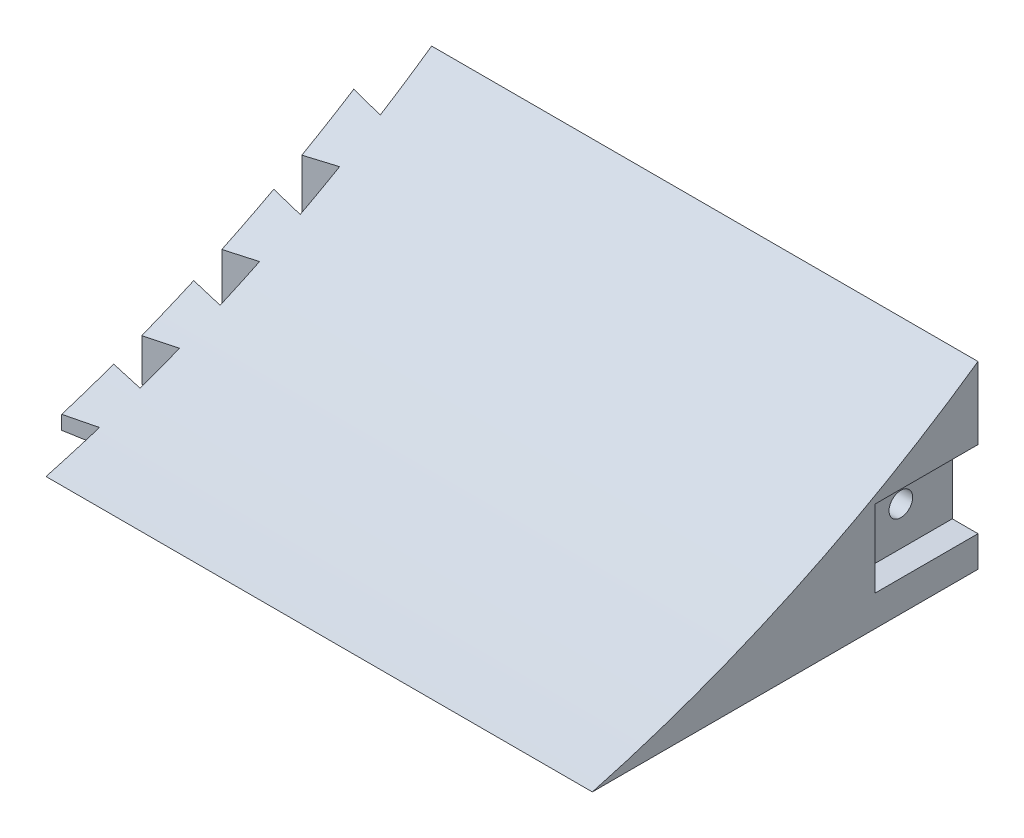
ISO-10303-21;
HEADER;
FILE_DESCRIPTION(('STEP AP214'),'2;1');
FILE_NAME('part.step','',(''),(''),'','','');
FILE_SCHEMA(('AUTOMOTIVE_DESIGN { 1 0 10303 214 1 1 1 1 }'));
ENDSEC;
DATA;
#1=APPLICATION_CONTEXT('core data for automotive mechanical design processes');
#2=APPLICATION_PROTOCOL_DEFINITION('international standard','automotive_design',2000,#1);
#3=PRODUCT_CONTEXT('',#1,'mechanical');
#4=PRODUCT('Part','Part','',(#3));
#5=PRODUCT_RELATED_PRODUCT_CATEGORY('part','',(#4));
#6=PRODUCT_DEFINITION_FORMATION('','',#4);
#7=PRODUCT_DEFINITION_CONTEXT('part definition',#1,'design');
#8=PRODUCT_DEFINITION('design','',#6,#7);
#9=PRODUCT_DEFINITION_SHAPE('','',#8);
#10=(LENGTH_UNIT() NAMED_UNIT(*) SI_UNIT(.MILLI.,.METRE.));
#11=(NAMED_UNIT(*) PLANE_ANGLE_UNIT() SI_UNIT($,.RADIAN.));
#12=(NAMED_UNIT(*) SI_UNIT($,.STERADIAN.) SOLID_ANGLE_UNIT());
#13=UNCERTAINTY_MEASURE_WITH_UNIT(LENGTH_MEASURE(1.E-05),#10,'distance_accuracy_value','');
#14=(GEOMETRIC_REPRESENTATION_CONTEXT(3) GLOBAL_UNCERTAINTY_ASSIGNED_CONTEXT((#13)) GLOBAL_UNIT_ASSIGNED_CONTEXT((#10,
#11,#12)) REPRESENTATION_CONTEXT('',''));
#15=CARTESIAN_POINT('',(0.,0.,0.));
#16=DIRECTION('',(0.,0.,1.));
#17=DIRECTION('',(1.,0.,0.));
#18=AXIS2_PLACEMENT_3D('',#15,#16,#17);
#19=CARTESIAN_POINT('',(0.,294.29273435255,79.3399426978569));
#20=DIRECTION('',(1.,0.,0.));
#21=DIRECTION('',(0.,0.,-1.));
#22=AXIS2_PLACEMENT_3D('',#19,#20,#21);
#23=PLANE('',#22);
#24=DIRECTION('',(0.,0.,-1.));
#25=VECTOR('',#24,1.);
#26=CARTESIAN_POINT('',(0.,0.,0.));
#27=LINE('',#26,#25);
#28=CARTESIAN_POINT('',(0.,0.,-23.241));
#29=VERTEX_POINT('',#28);
#30=CARTESIAN_POINT('',(0.,0.,-32.9776666666667));
#31=VERTEX_POINT('',#30);
#32=EDGE_CURVE('E315',#29,#31,#27,.T.);
#33=ORIENTED_EDGE('',*,*,#32,.F.);
#34=DIRECTION('',(0.,1.,0.));
#35=VECTOR('',#34,1.);
#36=CARTESIAN_POINT('',(0.,294.29273435255,-23.241));
#37=LINE('',#36,#35);
#38=CARTESIAN_POINT('',(0.,7.27323990100798,-23.241));
#39=VERTEX_POINT('',#38);
#40=EDGE_CURVE('E43',#29,#39,#37,.T.);
#41=ORIENTED_EDGE('',*,*,#40,.T.);
#42=CARTESIAN_POINT('',(0.,294.29273435255,79.3399426978569));
#43=DIRECTION('',(-1.,0.,0.));
#44=DIRECTION('',(0.,0.,-1.));
#45=AXIS2_PLACEMENT_3D('',#42,#43,#44);
#46=CIRCLE('',#45,304.8);
#47=CARTESIAN_POINT('',(0.,10.9417247784918,-32.9776666666667));
#48=VERTEX_POINT('',#47);
#49=EDGE_CURVE('E192',#48,#39,#46,.T.);
#50=ORIENTED_EDGE('',*,*,#49,.F.);
#51=DIRECTION('',(0.,-1.,0.));
#52=VECTOR('',#51,1.);
#53=CARTESIAN_POINT('',(0.,294.29273435255,-32.9776666666667));
#54=LINE('',#53,#52);
#55=EDGE_CURVE('E329',#48,#31,#54,.T.);
#56=ORIENTED_EDGE('',*,*,#55,.T.);
#57=EDGE_LOOP('',(#33,#41,#50,#56));
#58=FACE_BOUND('',#57,.T.);
#59=ADVANCED_FACE('F35',(#58),#23,.F.);
#60=CARTESIAN_POINT('',(0.,0.,-43.0106666666667));
#61=VERTEX_POINT('',#60);
#62=CARTESIAN_POINT('',(0.,0.,-52.7473333333333));
#63=VERTEX_POINT('',#62);
#64=EDGE_CURVE('E342',#61,#63,#27,.T.);
#65=ORIENTED_EDGE('',*,*,#64,.F.);
#66=DIRECTION('',(0.,1.,0.));
#67=VECTOR('',#66,1.);
#68=CARTESIAN_POINT('',(0.,294.29273435255,-43.0106666666667));
#69=LINE('',#68,#67);
#70=CARTESIAN_POINT('',(0.,15.1272486847663,-43.0106666666667));
#71=VERTEX_POINT('',#70);
#72=EDGE_CURVE('E332',#61,#71,#69,.T.);
#73=ORIENTED_EDGE('',*,*,#72,.T.);
#74=CARTESIAN_POINT('',(0.,19.6001943907593,-52.7473333333333));
#75=VERTEX_POINT('',#74);
#76=EDGE_CURVE('E675',#75,#71,#46,.T.);
#77=ORIENTED_EDGE('',*,*,#76,.F.);
#78=DIRECTION('',(0.,-1.,0.));
#79=VECTOR('',#78,1.);
#80=CARTESIAN_POINT('',(0.,294.29273435255,-52.7473333333333));
#81=LINE('',#80,#79);
#82=EDGE_CURVE('E253',#75,#63,#81,.T.);
#83=ORIENTED_EDGE('',*,*,#82,.T.);
#84=EDGE_LOOP('',(#65,#73,#77,#83));
#85=FACE_BOUND('',#84,.T.);
#86=ADVANCED_FACE('F428',(#85),#23,.F.);
#87=CARTESIAN_POINT('',(0.,0.,-62.7803333333333));
#88=VERTEX_POINT('',#87);
#89=CARTESIAN_POINT('',(0.,0.,-72.517));
#90=VERTEX_POINT('',#89);
#91=EDGE_CURVE('E343',#88,#90,#27,.T.);
#92=ORIENTED_EDGE('',*,*,#91,.F.);
#93=DIRECTION('',(0.,1.,0.));
#94=VECTOR('',#93,1.);
#95=CARTESIAN_POINT('',(0.,294.29273435255,-62.7803333333333));
#96=LINE('',#95,#94);
#97=CARTESIAN_POINT('',(0.,24.654333636298,-62.7803333333333));
#98=VERTEX_POINT('',#97);
#99=EDGE_CURVE('E326',#88,#98,#96,.T.);
#100=ORIENTED_EDGE('',*,*,#99,.T.);
#101=CARTESIAN_POINT('',(0.,30.0154009422486,-72.517));
#102=VERTEX_POINT('',#101);
#103=EDGE_CURVE('E311',#102,#98,#46,.T.);
#104=ORIENTED_EDGE('',*,*,#103,.F.);
#105=DIRECTION('',(0.,-1.,0.));
#106=VECTOR('',#105,1.);
#107=CARTESIAN_POINT('',(0.,38.1,-72.517));
#108=LINE('',#107,#106);
#109=EDGE_CURVE('E254',#102,#90,#108,.T.);
#110=ORIENTED_EDGE('',*,*,#109,.T.);
#111=EDGE_LOOP('',(#92,#100,#104,#110));
#112=FACE_BOUND('',#111,.T.);
#113=ADVANCED_FACE('F433',(#112),#23,.F.);
#114=DIRECTION('',(0.,-1.,0.));
#115=VECTOR('',#114,1.);
#116=CARTESIAN_POINT('',(0.,38.1,-82.55));
#117=LINE('',#116,#115);
#118=CARTESIAN_POINT('',(0.,36.0395902220584,-82.55));
#119=VERTEX_POINT('',#118);
#120=CARTESIAN_POINT('',(0.,0.,-82.55));
#121=VERTEX_POINT('',#120);
#122=EDGE_CURVE('E251',#119,#121,#117,.T.);
#123=ORIENTED_EDGE('',*,*,#122,.F.);
#124=CARTESIAN_POINT('',(0.,44.45,-95.25));
#125=VERTEX_POINT('',#124);
#126=EDGE_CURVE('E308',#125,#119,#46,.T.);
#127=ORIENTED_EDGE('',*,*,#126,.F.);
#128=DIRECTION('',(0.,1.,0.));
#129=VECTOR('',#128,1.);
#130=CARTESIAN_POINT('',(0.,0.,-95.25));
#131=LINE('',#130,#129);
#132=CARTESIAN_POINT('',(0.,0.,-95.25));
#133=VERTEX_POINT('',#132);
#134=EDGE_CURVE('E301',#133,#125,#131,.T.);
#135=ORIENTED_EDGE('',*,*,#134,.F.);
#136=EDGE_CURVE('E310',#121,#133,#27,.T.);
#137=ORIENTED_EDGE('',*,*,#136,.F.);
#138=EDGE_LOOP('',(#123,#127,#135,#137));
#139=FACE_BOUND('',#138,.T.);
#140=ADVANCED_FACE('F361',(#139),#23,.F.);
#141=CARTESIAN_POINT('',(134.9375,294.29273435255,79.3399426978569));
#142=DIRECTION('',(-1.,0.,0.));
#143=DIRECTION('',(0.,0.,1.));
#144=AXIS2_PLACEMENT_3D('',#141,#142,#143);
#145=CYLINDRICAL_SURFACE('',#144,304.8);
#146=ORIENTED_EDGE('',*,*,#126,.T.);
#147=CARTESIAN_POINT('',(918.123488801337,294.292734352556,79.3399426978596));
#148=DIRECTION('',(0.173648177666928,0.,-0.984807753012208));
#149=DIRECTION('',(0.984807753012209,0.,0.173648177666928));
#150=AXIS2_PLACEMENT_3D('',#147,#148,#149);
#151=ELLIPSE('',#150,1755.27324326224,304.800000000006);
#152=CARTESIAN_POINT('',(-7.92278070200611,36.9206023250389,-83.947));
#153=VERTEX_POINT('',#152);
#154=EDGE_CURVE('E362',#119,#153,#151,.T.);
#155=ORIENTED_EDGE('',*,*,#154,.T.);
#156=CARTESIAN_POINT('',(-7.92278070200611,294.292734352556,79.3399426978596));
#157=DIRECTION('',(1.,0.,0.));
#158=DIRECTION('',(0.,0.,-1.));
#159=AXIS2_PLACEMENT_3D('',#156,#157,#158);
#160=CIRCLE('',#159,304.800000000006);
#161=CARTESIAN_POINT('',(-7.92278070200611,29.2175645547031,-71.12));
#162=VERTEX_POINT('',#161);
#163=EDGE_CURVE('E50',#162,#153,#160,.T.);
#164=ORIENTED_EDGE('',*,*,#163,.F.);
#165=CARTESIAN_POINT('',(-861.223518305121,294.292734352556,79.3399426978596));
#166=DIRECTION('',(0.173648177666926,0.,0.984807753012209));
#167=DIRECTION('',(0.984807753012209,0.,-0.173648177666926));
#168=AXIS2_PLACEMENT_3D('',#165,#166,#167);
#169=ELLIPSE('',#168,1755.27324326226,304.800000000006);
#170=EDGE_CURVE('E394',#162,#102,#169,.T.);
#171=ORIENTED_EDGE('',*,*,#170,.T.);
#172=ORIENTED_EDGE('',*,*,#103,.T.);
#173=CARTESIAN_POINT('',(806.004137654767,294.292734352556,79.3399426978596));
#174=DIRECTION('',(0.173648177666928,0.,-0.984807753012208));
#175=DIRECTION('',(0.984807753012209,0.,0.173648177666928));
#176=AXIS2_PLACEMENT_3D('',#173,#174,#175);
#177=ELLIPSE('',#176,1755.27324326224,304.800000000006);
#178=CARTESIAN_POINT('',(-7.92278070200611,25.3952976213924,-64.1773333333333));
#179=VERTEX_POINT('',#178);
#180=EDGE_CURVE('E390',#98,#179,#177,.T.);
#181=ORIENTED_EDGE('',*,*,#180,.T.);
#182=CARTESIAN_POINT('',(-7.92278070200611,18.932803079151,-51.3503333333333));
#183=VERTEX_POINT('',#182);
#184=EDGE_CURVE('E57',#183,#179,#160,.T.);
#185=ORIENTED_EDGE('',*,*,#184,.F.);
#186=CARTESIAN_POINT('',(-749.104167158549,294.292734352556,79.3399426978596));
#187=DIRECTION('',(0.173648177666926,0.,0.984807753012209));
#188=DIRECTION('',(0.984807753012209,0.,-0.173648177666926));
#189=AXIS2_PLACEMENT_3D('',#186,#187,#188);
#190=ELLIPSE('',#189,1755.27324326226,304.800000000006);
#191=EDGE_CURVE('E396',#183,#75,#190,.T.);
#192=ORIENTED_EDGE('',*,*,#191,.T.);
#193=ORIENTED_EDGE('',*,*,#76,.T.);
#194=CARTESIAN_POINT('',(693.884786508196,294.292734352556,79.3399426978596));
#195=DIRECTION('',(0.173648177666928,0.,-0.984807753012208));
#196=DIRECTION('',(0.984807753012209,0.,0.173648177666928));
#197=AXIS2_PLACEMENT_3D('',#194,#195,#196);
#198=ELLIPSE('',#197,1755.27324326224,304.800000000006);
#199=CARTESIAN_POINT('',(-7.92278070200611,15.7436916750261,-44.4076666666667));
#200=VERTEX_POINT('',#199);
#201=EDGE_CURVE('E197',#71,#200,#198,.T.);
#202=ORIENTED_EDGE('',*,*,#201,.T.);
#203=CARTESIAN_POINT('',(-7.92278070200611,10.3919446069022,-31.5806666666667));
#204=VERTEX_POINT('',#203);
#205=EDGE_CURVE('E207',#204,#200,#160,.T.);
#206=ORIENTED_EDGE('',*,*,#205,.F.);
#207=CARTESIAN_POINT('',(-636.984816011977,294.292734352556,79.3399426978596));
#208=DIRECTION('',(0.173648177666926,0.,0.984807753012209));
#209=DIRECTION('',(0.984807753012209,0.,-0.173648177666926));
#210=AXIS2_PLACEMENT_3D('',#207,#208,#209);
#211=ELLIPSE('',#210,1755.27324326226,304.800000000006);
#212=EDGE_CURVE('E198',#204,#48,#211,.T.);
#213=ORIENTED_EDGE('',*,*,#212,.T.);
#214=ORIENTED_EDGE('',*,*,#49,.T.);
#215=CARTESIAN_POINT('',(581.765435361626,294.292734352556,79.3399426978596));
#216=DIRECTION('',(0.173648177666928,0.,-0.984807753012208));
#217=DIRECTION('',(0.984807753012209,0.,0.173648177666928));
#218=AXIS2_PLACEMENT_3D('',#215,#216,#217);
#219=ELLIPSE('',#218,1755.27324326224,304.800000000006);
#220=CARTESIAN_POINT('',(-7.92278070200611,7.77636931850706,-24.638));
#221=VERTEX_POINT('',#220);
#222=EDGE_CURVE('E186',#39,#221,#219,.T.);
#223=ORIENTED_EDGE('',*,*,#222,.T.);
#224=CARTESIAN_POINT('',(-7.92278070200611,3.44131928758641,-11.811));
#225=VERTEX_POINT('',#224);
#226=EDGE_CURVE('E189',#225,#221,#160,.T.);
#227=ORIENTED_EDGE('',*,*,#226,.F.);
#228=CARTESIAN_POINT('',(-524.865464865405,294.292734352556,79.3399426978596));
#229=DIRECTION('',(0.173648177666926,0.,0.984807753012209));
#230=DIRECTION('',(0.984807753012209,0.,-0.173648177666926));
#231=AXIS2_PLACEMENT_3D('',#228,#229,#230);
#232=ELLIPSE('',#231,1755.27324326226,304.800000000006);
#233=CARTESIAN_POINT('',(0.,3.8828200892899,-13.208));
#234=VERTEX_POINT('',#233);
#235=EDGE_CURVE('E11',#225,#234,#232,.T.);
#236=ORIENTED_EDGE('',*,*,#235,.T.);
#237=CARTESIAN_POINT('',(0.,0.,0.));
#238=VERTEX_POINT('',#237);
#239=EDGE_CURVE('E291',#234,#238,#46,.T.);
#240=ORIENTED_EDGE('',*,*,#239,.T.);
#241=DIRECTION('',(-1.,0.,0.));
#242=VECTOR('',#241,1.);
#243=CARTESIAN_POINT('',(134.9375,0.,0.));
#244=LINE('',#243,#242);
#245=CARTESIAN_POINT('',(134.9375,0.,0.));
#246=VERTEX_POINT('',#245);
#247=EDGE_CURVE('E261',#246,#238,#244,.T.);
#248=ORIENTED_EDGE('',*,*,#247,.F.);
#249=CARTESIAN_POINT('',(134.9375,294.29273435255,79.3399426978569));
#250=DIRECTION('',(-1.,0.,0.));
#251=DIRECTION('',(0.,0.,-1.));
#252=AXIS2_PLACEMENT_3D('',#249,#250,#251);
#253=CIRCLE('',#252,304.8);
#254=CARTESIAN_POINT('',(134.9375,44.45,-95.25));
#255=VERTEX_POINT('',#254);
#256=EDGE_CURVE('E297',#255,#246,#253,.T.);
#257=ORIENTED_EDGE('',*,*,#256,.F.);
#258=DIRECTION('',(-1.,0.,0.));
#259=VECTOR('',#258,1.);
#260=CARTESIAN_POINT('',(134.9375,44.45,-95.25));
#261=LINE('',#260,#259);
#262=EDGE_CURVE('E307',#255,#125,#261,.T.);
#263=ORIENTED_EDGE('',*,*,#262,.T.);
#264=EDGE_LOOP('',(#146,#155,#164,#171,#172,#181,#185,#192,#193,#202,#206,#213,#214,#223,#227,
#236,#240,#248,#257,#263));
#265=FACE_BOUND('',#264,.T.);
#266=ADVANCED_FACE('F37',(#265),#145,.F.);
#267=CARTESIAN_POINT('',(134.9375,0.,0.));
#268=DIRECTION('',(0.,1.,0.));
#269=DIRECTION('',(0.,0.,1.));
#270=AXIS2_PLACEMENT_3D('',#267,#268,#269);
#271=PLANE('',#270);
#272=CARTESIAN_POINT('',(0.,0.,-13.208));
#273=VERTEX_POINT('',#272);
#274=EDGE_CURVE('E312',#238,#273,#27,.T.);
#275=ORIENTED_EDGE('',*,*,#274,.T.);
#276=DIRECTION('',(-0.984807753012209,0.,0.173648177666926));
#277=VECTOR('',#276,1.);
#278=CARTESIAN_POINT('',(-7.92278070200611,0.,-11.811));
#279=LINE('',#278,#277);
#280=CARTESIAN_POINT('',(-7.92278070200611,0.,-11.811));
#281=VERTEX_POINT('',#280);
#282=EDGE_CURVE('E387',#273,#281,#279,.T.);
#283=ORIENTED_EDGE('',*,*,#282,.T.);
#284=DIRECTION('',(0.,0.,-1.));
#285=VECTOR('',#284,1.);
#286=CARTESIAN_POINT('',(-7.92278070200611,0.,-24.638));
#287=LINE('',#286,#285);
#288=CARTESIAN_POINT('',(-7.92278070200611,0.,-24.638));
#289=VERTEX_POINT('',#288);
#290=EDGE_CURVE('E388',#281,#289,#287,.T.);
#291=ORIENTED_EDGE('',*,*,#290,.T.);
#292=DIRECTION('',(0.984807753012209,0.,0.173648177666928));
#293=VECTOR('',#292,1.);
#294=CARTESIAN_POINT('',(0.,0.,-23.241));
#295=LINE('',#294,#293);
#296=EDGE_CURVE('E211',#289,#29,#295,.T.);
#297=ORIENTED_EDGE('',*,*,#296,.T.);
#298=ORIENTED_EDGE('',*,*,#32,.T.);
#299=DIRECTION('',(-0.984807753012209,0.,0.173648177666926));
#300=VECTOR('',#299,1.);
#301=CARTESIAN_POINT('',(-7.92278070200611,0.,-31.5806666666667));
#302=LINE('',#301,#300);
#303=CARTESIAN_POINT('',(-7.92278070200611,0.,-31.5806666666667));
#304=VERTEX_POINT('',#303);
#305=EDGE_CURVE('E212',#31,#304,#302,.T.);
#306=ORIENTED_EDGE('',*,*,#305,.T.);
#307=DIRECTION('',(0.,0.,-1.));
#308=VECTOR('',#307,1.);
#309=CARTESIAN_POINT('',(-7.92278070200611,0.,-44.4076666666667));
#310=LINE('',#309,#308);
#311=CARTESIAN_POINT('',(-7.92278070200611,0.,-44.4076666666667));
#312=VERTEX_POINT('',#311);
#313=EDGE_CURVE('E215',#304,#312,#310,.T.);
#314=ORIENTED_EDGE('',*,*,#313,.T.);
#315=DIRECTION('',(0.984807753012209,0.,0.173648177666928));
#316=VECTOR('',#315,1.);
#317=CARTESIAN_POINT('',(0.,0.,-43.0106666666667));
#318=LINE('',#317,#316);
#319=EDGE_CURVE('E223',#312,#61,#318,.T.);
#320=ORIENTED_EDGE('',*,*,#319,.T.);
#321=ORIENTED_EDGE('',*,*,#64,.T.);
#322=DIRECTION('',(-0.984807753012209,0.,0.173648177666926));
#323=VECTOR('',#322,1.);
#324=CARTESIAN_POINT('',(-7.92278070200611,0.,-51.3503333333333));
#325=LINE('',#324,#323);
#326=CARTESIAN_POINT('',(-7.92278070200611,0.,-51.3503333333333));
#327=VERTEX_POINT('',#326);
#328=EDGE_CURVE('E228',#63,#327,#325,.T.);
#329=ORIENTED_EDGE('',*,*,#328,.T.);
#330=DIRECTION('',(0.,0.,-1.));
#331=VECTOR('',#330,1.);
#332=CARTESIAN_POINT('',(-7.92278070200611,0.,-64.1773333333333));
#333=LINE('',#332,#331);
#334=CARTESIAN_POINT('',(-7.92278070200611,0.,-64.1773333333333));
#335=VERTEX_POINT('',#334);
#336=EDGE_CURVE('E232',#327,#335,#333,.T.);
#337=ORIENTED_EDGE('',*,*,#336,.T.);
#338=DIRECTION('',(0.984807753012209,0.,0.173648177666928));
#339=VECTOR('',#338,1.);
#340=CARTESIAN_POINT('',(0.,0.,-62.7803333333333));
#341=LINE('',#340,#339);
#342=EDGE_CURVE('E235',#335,#88,#341,.T.);
#343=ORIENTED_EDGE('',*,*,#342,.T.);
#344=ORIENTED_EDGE('',*,*,#91,.T.);
#345=DIRECTION('',(-0.984807753012209,0.,0.173648177666926));
#346=VECTOR('',#345,1.);
#347=CARTESIAN_POINT('',(-7.92278070200611,0.,-71.12));
#348=LINE('',#347,#346);
#349=CARTESIAN_POINT('',(-7.92278070200611,0.,-71.12));
#350=VERTEX_POINT('',#349);
#351=EDGE_CURVE('E240',#90,#350,#348,.T.);
#352=ORIENTED_EDGE('',*,*,#351,.T.);
#353=DIRECTION('',(0.,0.,-1.));
#354=VECTOR('',#353,1.);
#355=CARTESIAN_POINT('',(-7.92278070200611,0.,-83.947));
#356=LINE('',#355,#354);
#357=CARTESIAN_POINT('',(-7.92278070200611,0.,-83.947));
#358=VERTEX_POINT('',#357);
#359=EDGE_CURVE('E244',#350,#358,#356,.T.);
#360=ORIENTED_EDGE('',*,*,#359,.T.);
#361=DIRECTION('',(0.984807753012209,0.,0.173648177666928));
#362=VECTOR('',#361,1.);
#363=CARTESIAN_POINT('',(0.,0.,-82.55));
#364=LINE('',#363,#362);
#365=EDGE_CURVE('E247',#358,#121,#364,.T.);
#366=ORIENTED_EDGE('',*,*,#365,.T.);
#367=ORIENTED_EDGE('',*,*,#136,.T.);
#368=DIRECTION('',(-1.,0.,0.));
#369=VECTOR('',#368,1.);
#370=CARTESIAN_POINT('',(134.9375,0.,-95.25));
#371=LINE('',#370,#369);
#372=CARTESIAN_POINT('',(134.9375,0.,-95.25));
#373=VERTEX_POINT('',#372);
#374=EDGE_CURVE('E319',#373,#133,#371,.T.);
#375=ORIENTED_EDGE('',*,*,#374,.F.);
#376=DIRECTION('',(0.,0.,-1.));
#377=VECTOR('',#376,1.);
#378=CARTESIAN_POINT('',(134.9375,0.,0.));
#379=LINE('',#378,#377);
#380=EDGE_CURVE('E300',#246,#373,#379,.T.);
#381=ORIENTED_EDGE('',*,*,#380,.F.);
#382=ORIENTED_EDGE('',*,*,#247,.T.);
#383=EDGE_LOOP('',(#275,#283,#291,#297,#298,#306,#314,#320,#321,#329,#337,#343,#344,#352,#360,
#366,#367,#375,#381,#382));
#384=FACE_BOUND('',#383,.T.);
#385=ADVANCED_FACE('F350',(#384),#271,.F.);
#386=CARTESIAN_POINT('',(134.9375,0.,-95.25));
#387=DIRECTION('',(0.,0.,1.));
#388=DIRECTION('',(1.,0.,0.));
#389=AXIS2_PLACEMENT_3D('',#386,#387,#388);
#390=PLANE('',#389);
#391=DIRECTION('',(0.,1.,0.));
#392=VECTOR('',#391,1.);
#393=CARTESIAN_POINT('',(128.5875,26.67,-95.25));
#394=LINE('',#393,#392);
#395=CARTESIAN_POINT('',(128.5875,7.62,-95.25));
#396=VERTEX_POINT('',#395);
#397=CARTESIAN_POINT('',(128.5875,26.67,-95.25));
#398=VERTEX_POINT('',#397);
#399=EDGE_CURVE('E268',#396,#398,#394,.T.);
#400=ORIENTED_EDGE('',*,*,#399,.F.);
#401=DIRECTION('',(1.,0.,0.));
#402=VECTOR('',#401,1.);
#403=CARTESIAN_POINT('',(128.5875,7.62,-95.25));
#404=LINE('',#403,#402);
#405=CARTESIAN_POINT('',(134.9375,7.62,-95.25));
#406=VERTEX_POINT('',#405);
#407=EDGE_CURVE('E288',#396,#406,#404,.T.);
#408=ORIENTED_EDGE('',*,*,#407,.T.);
#409=DIRECTION('',(0.,1.,0.));
#410=VECTOR('',#409,1.);
#411=CARTESIAN_POINT('',(134.9375,0.,-95.25));
#412=LINE('',#411,#410);
#413=EDGE_CURVE('E304',#373,#406,#412,.T.);
#414=ORIENTED_EDGE('',*,*,#413,.F.);
#415=ORIENTED_EDGE('',*,*,#374,.T.);
#416=ORIENTED_EDGE('',*,*,#134,.T.);
#417=ORIENTED_EDGE('',*,*,#262,.F.);
#418=CARTESIAN_POINT('',(134.9375,26.67,-95.25));
#419=VERTEX_POINT('',#418);
#420=EDGE_CURVE('E303',#419,#255,#412,.T.);
#421=ORIENTED_EDGE('',*,*,#420,.F.);
#422=DIRECTION('',(1.,0.,0.));
#423=VECTOR('',#422,1.);
#424=CARTESIAN_POINT('',(128.5875,26.67,-95.25));
#425=LINE('',#424,#423);
#426=EDGE_CURVE('E281',#398,#419,#425,.T.);
#427=ORIENTED_EDGE('',*,*,#426,.F.);
#428=EDGE_LOOP('',(#400,#408,#414,#415,#416,#417,#421,#427));
#429=FACE_BOUND('',#428,.T.);
#430=ADVANCED_FACE('F358',(#429),#390,.F.);
#431=CARTESIAN_POINT('',(134.9375,294.29273435255,79.3399426978569));
#432=DIRECTION('',(1.,0.,0.));
#433=DIRECTION('',(0.,0.,-1.));
#434=AXIS2_PLACEMENT_3D('',#431,#432,#433);
#435=PLANE('',#434);
#436=DIRECTION('',(0.,0.,-1.));
#437=VECTOR('',#436,1.);
#438=CARTESIAN_POINT('',(134.9375,7.62,-95.25));
#439=LINE('',#438,#437);
#440=CARTESIAN_POINT('',(134.9375,7.62,-69.85));
#441=VERTEX_POINT('',#440);
#442=EDGE_CURVE('E272',#441,#406,#439,.T.);
#443=ORIENTED_EDGE('',*,*,#442,.F.);
#444=DIRECTION('',(0.,-1.,0.));
#445=VECTOR('',#444,1.);
#446=CARTESIAN_POINT('',(134.9375,26.67,-69.85));
#447=LINE('',#446,#445);
#448=CARTESIAN_POINT('',(134.9375,26.67,-69.85));
#449=VERTEX_POINT('',#448);
#450=EDGE_CURVE('E284',#449,#441,#447,.T.);
#451=ORIENTED_EDGE('',*,*,#450,.F.);
#452=DIRECTION('',(0.,0.,1.));
#453=VECTOR('',#452,1.);
#454=CARTESIAN_POINT('',(134.9375,26.67,-95.25));
#455=LINE('',#454,#453);
#456=EDGE_CURVE('E265',#419,#449,#455,.T.);
#457=ORIENTED_EDGE('',*,*,#456,.F.);
#458=ORIENTED_EDGE('',*,*,#420,.T.);
#459=ORIENTED_EDGE('',*,*,#256,.T.);
#460=ORIENTED_EDGE('',*,*,#380,.T.);
#461=ORIENTED_EDGE('',*,*,#413,.T.);
#462=EDGE_LOOP('',(#443,#451,#457,#458,#459,#460,#461));
#463=FACE_BOUND('',#462,.T.);
#464=ADVANCED_FACE('F370',(#463),#435,.T.);
#465=ORIENTED_EDGE('',*,*,#239,.F.);
#466=DIRECTION('',(0.,-1.,0.));
#467=VECTOR('',#466,1.);
#468=CARTESIAN_POINT('',(0.,294.29273435255,-13.208));
#469=LINE('',#468,#467);
#470=EDGE_CURVE('E335',#234,#273,#469,.T.);
#471=ORIENTED_EDGE('',*,*,#470,.T.);
#472=ORIENTED_EDGE('',*,*,#274,.F.);
#473=EDGE_LOOP('',(#465,#471,#472));
#474=FACE_BOUND('',#473,.T.);
#475=ADVANCED_FACE('F384',(#474),#23,.F.);
#476=CARTESIAN_POINT('',(128.5875,7.62,-95.25));
#477=DIRECTION('',(0.,-1.,0.));
#478=DIRECTION('',(0.,0.,-1.));
#479=AXIS2_PLACEMENT_3D('',#476,#477,#478);
#480=PLANE('',#479);
#481=ORIENTED_EDGE('',*,*,#442,.T.);
#482=ORIENTED_EDGE('',*,*,#407,.F.);
#483=DIRECTION('',(0.,0.,-1.));
#484=VECTOR('',#483,1.);
#485=CARTESIAN_POINT('',(128.5875,7.62,-95.25));
#486=LINE('',#485,#484);
#487=CARTESIAN_POINT('',(128.5875,7.62,-69.85));
#488=VERTEX_POINT('',#487);
#489=EDGE_CURVE('E278',#488,#396,#486,.T.);
#490=ORIENTED_EDGE('',*,*,#489,.F.);
#491=DIRECTION('',(1.,0.,0.));
#492=VECTOR('',#491,1.);
#493=CARTESIAN_POINT('',(128.5875,7.62,-69.85));
#494=LINE('',#493,#492);
#495=EDGE_CURVE('E292',#488,#441,#494,.T.);
#496=ORIENTED_EDGE('',*,*,#495,.T.);
#497=EDGE_LOOP('',(#481,#482,#490,#496));
#498=FACE_BOUND('',#497,.T.);
#499=ADVANCED_FACE('F438',(#498),#480,.F.);
#500=CARTESIAN_POINT('',(128.5875,26.67,-69.85));
#501=DIRECTION('',(0.,0.,1.));
#502=DIRECTION('',(1.,0.,0.));
#503=AXIS2_PLACEMENT_3D('',#500,#501,#502);
#504=PLANE('',#503);
#505=ORIENTED_EDGE('',*,*,#450,.T.);
#506=ORIENTED_EDGE('',*,*,#495,.F.);
#507=DIRECTION('',(0.,-1.,0.));
#508=VECTOR('',#507,1.);
#509=CARTESIAN_POINT('',(128.5875,26.67,-69.85));
#510=LINE('',#509,#508);
#511=CARTESIAN_POINT('',(128.5875,26.67,-69.85));
#512=VERTEX_POINT('',#511);
#513=EDGE_CURVE('E275',#512,#488,#510,.T.);
#514=ORIENTED_EDGE('',*,*,#513,.F.);
#515=DIRECTION('',(1.,0.,0.));
#516=VECTOR('',#515,1.);
#517=CARTESIAN_POINT('',(128.5875,26.67,-69.85));
#518=LINE('',#517,#516);
#519=EDGE_CURVE('E294',#512,#449,#518,.T.);
#520=ORIENTED_EDGE('',*,*,#519,.T.);
#521=EDGE_LOOP('',(#505,#506,#514,#520));
#522=FACE_BOUND('',#521,.T.);
#523=ADVANCED_FACE('F443',(#522),#504,.F.);
#524=CARTESIAN_POINT('',(128.5875,26.67,-95.25));
#525=DIRECTION('',(0.,1.,0.));
#526=DIRECTION('',(0.,0.,1.));
#527=AXIS2_PLACEMENT_3D('',#524,#525,#526);
#528=PLANE('',#527);
#529=ORIENTED_EDGE('',*,*,#456,.T.);
#530=ORIENTED_EDGE('',*,*,#519,.F.);
#531=DIRECTION('',(0.,0.,1.));
#532=VECTOR('',#531,1.);
#533=CARTESIAN_POINT('',(128.5875,26.67,-95.25));
#534=LINE('',#533,#532);
#535=EDGE_CURVE('E271',#398,#512,#534,.T.);
#536=ORIENTED_EDGE('',*,*,#535,.F.);
#537=ORIENTED_EDGE('',*,*,#426,.T.);
#538=EDGE_LOOP('',(#529,#530,#536,#537));
#539=FACE_BOUND('',#538,.T.);
#540=ADVANCED_FACE('F373',(#539),#528,.F.);
#541=CARTESIAN_POINT('',(128.5875,0.,0.));
#542=DIRECTION('',(-1.,0.,0.));
#543=DIRECTION('',(0.,0.,1.));
#544=AXIS2_PLACEMENT_3D('',#541,#542,#543);
#545=PLANE('',#544);
#546=CARTESIAN_POINT('',(128.5875,17.145,-82.55));
#547=DIRECTION('',(1.,0.,0.));
#548=DIRECTION('',(0.,0.,-1.));
#549=AXIS2_PLACEMENT_3D('',#546,#547,#548);
#550=CIRCLE('',#549,2.92100000000001);
#551=CARTESIAN_POINT('',(128.5875,17.145,-85.471));
#552=VERTEX_POINT('',#551);
#553=EDGE_CURVE('E257',#552,#552,#550,.T.);
#554=ORIENTED_EDGE('',*,*,#553,.F.);
#555=EDGE_LOOP('',(#554));
#556=FACE_BOUND('',#555,.T.);
#557=ORIENTED_EDGE('',*,*,#399,.T.);
#558=ORIENTED_EDGE('',*,*,#535,.T.);
#559=ORIENTED_EDGE('',*,*,#513,.T.);
#560=ORIENTED_EDGE('',*,*,#489,.T.);
#561=EDGE_LOOP('',(#557,#558,#559,#560));
#562=FACE_BOUND('',#561,.T.);
#563=ADVANCED_FACE('F376',(#556,#562),#545,.F.);
#564=CARTESIAN_POINT('',(103.1875,17.145,-82.55));
#565=DIRECTION('',(1.,0.,0.));
#566=DIRECTION('',(0.,0.,-1.));
#567=AXIS2_PLACEMENT_3D('',#564,#565,#566);
#568=CYLINDRICAL_SURFACE('',#567,2.92100000000001);
#569=CARTESIAN_POINT('',(103.1875,17.145,-82.55));
#570=DIRECTION('',(1.,0.,0.));
#571=DIRECTION('',(0.,0.,-1.));
#572=AXIS2_PLACEMENT_3D('',#569,#570,#571);
#573=CIRCLE('',#572,2.92100000000001);
#574=CARTESIAN_POINT('',(103.1875,17.145,-85.471));
#575=VERTEX_POINT('',#574);
#576=EDGE_CURVE('E262',#575,#575,#573,.T.);
#577=ORIENTED_EDGE('',*,*,#576,.F.);
#578=EDGE_LOOP('',(#577));
#579=FACE_BOUND('',#578,.T.);
#580=ORIENTED_EDGE('',*,*,#553,.T.);
#581=EDGE_LOOP('',(#580));
#582=FACE_BOUND('',#581,.T.);
#583=ADVANCED_FACE('F477',(#579,#582),#568,.F.);
#584=CARTESIAN_POINT('',(103.1875,17.145,-82.55));
#585=DIRECTION('',(1.,0.,0.));
#586=DIRECTION('',(0.,0.,-1.));
#587=AXIS2_PLACEMENT_3D('',#584,#585,#586);
#588=PLANE('',#587);
#589=ORIENTED_EDGE('',*,*,#576,.T.);
#590=EDGE_LOOP('',(#589));
#591=FACE_BOUND('',#590,.T.);
#592=ADVANCED_FACE('F471',(#591),#588,.T.);
#593=CARTESIAN_POINT('',(0.,38.1,-82.55));
#594=DIRECTION('',(0.173648177666928,0.,-0.984807753012208));
#595=DIRECTION('',(-0.984807753012209,0.,-0.173648177666928));
#596=AXIS2_PLACEMENT_3D('',#593,#594,#595);
#597=PLANE('',#596);
#598=ORIENTED_EDGE('',*,*,#154,.F.);
#599=ORIENTED_EDGE('',*,*,#122,.T.);
#600=ORIENTED_EDGE('',*,*,#365,.F.);
#601=DIRECTION('',(0.,-1.,0.));
#602=VECTOR('',#601,1.);
#603=CARTESIAN_POINT('',(-7.92278070200611,38.1,-83.947));
#604=LINE('',#603,#602);
#605=EDGE_CURVE('E255',#153,#358,#604,.T.);
#606=ORIENTED_EDGE('',*,*,#605,.F.);
#607=EDGE_LOOP('',(#598,#599,#600,#606));
#608=FACE_BOUND('',#607,.T.);
#609=ADVANCED_FACE('F461',(#608),#597,.T.);
#610=CARTESIAN_POINT('',(-7.92278070200611,38.1,-83.947));
#611=DIRECTION('',(-1.,0.,0.));
#612=DIRECTION('',(0.,0.,1.));
#613=AXIS2_PLACEMENT_3D('',#610,#611,#612);
#614=PLANE('',#613);
#615=ORIENTED_EDGE('',*,*,#163,.T.);
#616=ORIENTED_EDGE('',*,*,#605,.T.);
#617=ORIENTED_EDGE('',*,*,#359,.F.);
#618=DIRECTION('',(0.,-1.,0.));
#619=VECTOR('',#618,1.);
#620=CARTESIAN_POINT('',(-7.92278070200611,38.1,-71.12));
#621=LINE('',#620,#619);
#622=EDGE_CURVE('E250',#162,#350,#621,.T.);
#623=ORIENTED_EDGE('',*,*,#622,.F.);
#624=EDGE_LOOP('',(#615,#616,#617,#623));
#625=FACE_BOUND('',#624,.T.);
#626=ADVANCED_FACE('F462',(#625),#614,.T.);
#627=CARTESIAN_POINT('',(-7.92278070200611,38.1,-71.12));
#628=DIRECTION('',(0.173648177666926,0.,0.984807753012209));
#629=DIRECTION('',(0.984807753012209,0.,-0.173648177666926));
#630=AXIS2_PLACEMENT_3D('',#627,#628,#629);
#631=PLANE('',#630);
#632=ORIENTED_EDGE('',*,*,#170,.F.);
#633=ORIENTED_EDGE('',*,*,#622,.T.);
#634=ORIENTED_EDGE('',*,*,#351,.F.);
#635=ORIENTED_EDGE('',*,*,#109,.F.);
#636=EDGE_LOOP('',(#632,#633,#634,#635));
#637=FACE_BOUND('',#636,.T.);
#638=ADVANCED_FACE('F458',(#637),#631,.T.);
#639=CARTESIAN_POINT('',(0.,38.1,-62.7803333333333));
#640=DIRECTION('',(0.173648177666928,0.,-0.984807753012208));
#641=DIRECTION('',(-0.984807753012209,0.,-0.173648177666928));
#642=AXIS2_PLACEMENT_3D('',#639,#640,#641);
#643=PLANE('',#642);
#644=ORIENTED_EDGE('',*,*,#180,.F.);
#645=ORIENTED_EDGE('',*,*,#99,.F.);
#646=ORIENTED_EDGE('',*,*,#342,.F.);
#647=DIRECTION('',(0.,-1.,0.));
#648=VECTOR('',#647,1.);
#649=CARTESIAN_POINT('',(-7.92278070200611,38.1,-64.1773333333333));
#650=LINE('',#649,#648);
#651=EDGE_CURVE('E238',#179,#335,#650,.T.);
#652=ORIENTED_EDGE('',*,*,#651,.F.);
#653=EDGE_LOOP('',(#644,#645,#646,#652));
#654=FACE_BOUND('',#653,.T.);
#655=ADVANCED_FACE('F469',(#654),#643,.T.);
#656=CARTESIAN_POINT('',(-7.92278070200611,38.1,-64.1773333333333));
#657=DIRECTION('',(-1.,0.,0.));
#658=DIRECTION('',(0.,0.,1.));
#659=AXIS2_PLACEMENT_3D('',#656,#657,#658);
#660=PLANE('',#659);
#661=ORIENTED_EDGE('',*,*,#184,.T.);
#662=ORIENTED_EDGE('',*,*,#651,.T.);
#663=ORIENTED_EDGE('',*,*,#336,.F.);
#664=DIRECTION('',(0.,-1.,0.));
#665=VECTOR('',#664,1.);
#666=CARTESIAN_POINT('',(-7.92278070200611,38.1,-51.3503333333333));
#667=LINE('',#666,#665);
#668=EDGE_CURVE('E237',#183,#327,#667,.T.);
#669=ORIENTED_EDGE('',*,*,#668,.F.);
#670=EDGE_LOOP('',(#661,#662,#663,#669));
#671=FACE_BOUND('',#670,.T.);
#672=ADVANCED_FACE('F533',(#671),#660,.T.);
#673=CARTESIAN_POINT('',(-7.92278070200611,38.1,-51.3503333333333));
#674=DIRECTION('',(0.173648177666926,0.,0.984807753012209));
#675=DIRECTION('',(0.984807753012209,0.,-0.173648177666926));
#676=AXIS2_PLACEMENT_3D('',#673,#674,#675);
#677=PLANE('',#676);
#678=ORIENTED_EDGE('',*,*,#191,.F.);
#679=ORIENTED_EDGE('',*,*,#668,.T.);
#680=ORIENTED_EDGE('',*,*,#328,.F.);
#681=ORIENTED_EDGE('',*,*,#82,.F.);
#682=EDGE_LOOP('',(#678,#679,#680,#681));
#683=FACE_BOUND('',#682,.T.);
#684=ADVANCED_FACE('F542',(#683),#677,.T.);
#685=CARTESIAN_POINT('',(0.,38.1,-43.0106666666667));
#686=DIRECTION('',(0.173648177666928,0.,-0.984807753012208));
#687=DIRECTION('',(-0.984807753012209,0.,-0.173648177666928));
#688=AXIS2_PLACEMENT_3D('',#685,#686,#687);
#689=PLANE('',#688);
#690=ORIENTED_EDGE('',*,*,#201,.F.);
#691=ORIENTED_EDGE('',*,*,#72,.F.);
#692=ORIENTED_EDGE('',*,*,#319,.F.);
#693=DIRECTION('',(0.,-1.,0.));
#694=VECTOR('',#693,1.);
#695=CARTESIAN_POINT('',(-7.92278070200611,38.1,-44.4076666666667));
#696=LINE('',#695,#694);
#697=EDGE_CURVE('E226',#200,#312,#696,.T.);
#698=ORIENTED_EDGE('',*,*,#697,.F.);
#699=EDGE_LOOP('',(#690,#691,#692,#698));
#700=FACE_BOUND('',#699,.T.);
#701=ADVANCED_FACE('F414',(#700),#689,.T.);
#702=CARTESIAN_POINT('',(-7.92278070200611,38.1,-44.4076666666667));
#703=DIRECTION('',(-1.,0.,0.));
#704=DIRECTION('',(0.,0.,1.));
#705=AXIS2_PLACEMENT_3D('',#702,#703,#704);
#706=PLANE('',#705);
#707=ORIENTED_EDGE('',*,*,#205,.T.);
#708=ORIENTED_EDGE('',*,*,#697,.T.);
#709=ORIENTED_EDGE('',*,*,#313,.F.);
#710=DIRECTION('',(0.,-1.,0.));
#711=VECTOR('',#710,1.);
#712=CARTESIAN_POINT('',(-7.92278070200611,38.1,-31.5806666666667));
#713=LINE('',#712,#711);
#714=EDGE_CURVE('E225',#204,#304,#713,.T.);
#715=ORIENTED_EDGE('',*,*,#714,.F.);
#716=EDGE_LOOP('',(#707,#708,#709,#715));
#717=FACE_BOUND('',#716,.T.);
#718=ADVANCED_FACE('F409',(#717),#706,.T.);
#719=CARTESIAN_POINT('',(-7.92278070200611,38.1,-31.5806666666667));
#720=DIRECTION('',(0.173648177666926,0.,0.984807753012209));
#721=DIRECTION('',(0.984807753012209,0.,-0.173648177666926));
#722=AXIS2_PLACEMENT_3D('',#719,#720,#721);
#723=PLANE('',#722);
#724=ORIENTED_EDGE('',*,*,#212,.F.);
#725=ORIENTED_EDGE('',*,*,#714,.T.);
#726=ORIENTED_EDGE('',*,*,#305,.F.);
#727=ORIENTED_EDGE('',*,*,#55,.F.);
#728=EDGE_LOOP('',(#724,#725,#726,#727));
#729=FACE_BOUND('',#728,.T.);
#730=ADVANCED_FACE('F417',(#729),#723,.T.);
#731=CARTESIAN_POINT('',(0.,38.1,-23.241));
#732=DIRECTION('',(0.173648177666928,0.,-0.984807753012208));
#733=DIRECTION('',(-0.984807753012209,0.,-0.173648177666928));
#734=AXIS2_PLACEMENT_3D('',#731,#732,#733);
#735=PLANE('',#734);
#736=ORIENTED_EDGE('',*,*,#222,.F.);
#737=ORIENTED_EDGE('',*,*,#40,.F.);
#738=ORIENTED_EDGE('',*,*,#296,.F.);
#739=DIRECTION('',(0.,-1.,0.));
#740=VECTOR('',#739,1.);
#741=CARTESIAN_POINT('',(-7.92278070200611,38.1,-24.638));
#742=LINE('',#741,#740);
#743=EDGE_CURVE('E204',#221,#289,#742,.T.);
#744=ORIENTED_EDGE('',*,*,#743,.F.);
#745=EDGE_LOOP('',(#736,#737,#738,#744));
#746=FACE_BOUND('',#745,.T.);
#747=ADVANCED_FACE('F210',(#746),#735,.T.);
#748=CARTESIAN_POINT('',(-7.92278070200611,38.1,-24.638));
#749=DIRECTION('',(-1.,0.,0.));
#750=DIRECTION('',(0.,0.,1.));
#751=AXIS2_PLACEMENT_3D('',#748,#749,#750);
#752=PLANE('',#751);
#753=ORIENTED_EDGE('',*,*,#226,.T.);
#754=ORIENTED_EDGE('',*,*,#743,.T.);
#755=ORIENTED_EDGE('',*,*,#290,.F.);
#756=DIRECTION('',(0.,-1.,0.));
#757=VECTOR('',#756,1.);
#758=CARTESIAN_POINT('',(-7.92278070200611,38.1,-11.811));
#759=LINE('',#758,#757);
#760=EDGE_CURVE('E206',#225,#281,#759,.T.);
#761=ORIENTED_EDGE('',*,*,#760,.F.);
#762=EDGE_LOOP('',(#753,#754,#755,#761));
#763=FACE_BOUND('',#762,.T.);
#764=ADVANCED_FACE('F202',(#763),#752,.T.);
#765=CARTESIAN_POINT('',(-7.92278070200611,38.1,-11.811));
#766=DIRECTION('',(0.173648177666926,0.,0.984807753012209));
#767=DIRECTION('',(0.984807753012209,0.,-0.173648177666926));
#768=AXIS2_PLACEMENT_3D('',#765,#766,#767);
#769=PLANE('',#768);
#770=ORIENTED_EDGE('',*,*,#235,.F.);
#771=ORIENTED_EDGE('',*,*,#760,.T.);
#772=ORIENTED_EDGE('',*,*,#282,.F.);
#773=ORIENTED_EDGE('',*,*,#470,.F.);
#774=EDGE_LOOP('',(#770,#771,#772,#773));
#775=FACE_BOUND('',#774,.T.);
#776=ADVANCED_FACE('F386',(#775),#769,.T.);
#777=CLOSED_SHELL('',(#59,#86,#113,#140,#266,#385,#430,#464,#475,#499,#523,#540,#563,#583,#592,
#609,#626,#638,#655,#672,#684,#701,#718,#730,#747,#764,#776));
#778=MANIFOLD_SOLID_BREP('B2',#777);
#779=ADVANCED_BREP_SHAPE_REPRESENTATION('',(#18,#778),#14);
#780=SHAPE_DEFINITION_REPRESENTATION(#9,#779);
ENDSEC;
END-ISO-10303-21;
